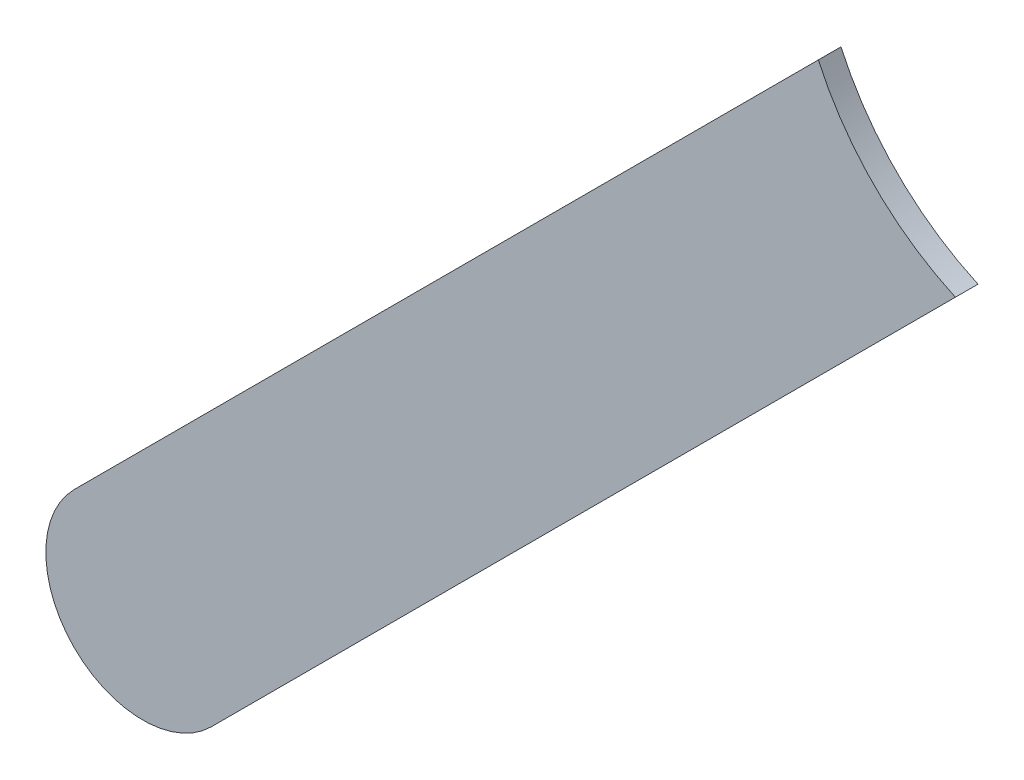
ISO-10303-21;
HEADER;
FILE_DESCRIPTION(('STEP AP214'),'2;1');
FILE_NAME('part.step','',(''),(''),'','','');
FILE_SCHEMA(('AUTOMOTIVE_DESIGN { 1 0 10303 214 1 1 1 1 }'));
ENDSEC;
DATA;
#1=APPLICATION_CONTEXT('core data for automotive mechanical design processes');
#2=APPLICATION_PROTOCOL_DEFINITION('international standard','automotive_design',2000,#1);
#3=PRODUCT_CONTEXT('',#1,'mechanical');
#4=PRODUCT('Part','Part','',(#3));
#5=PRODUCT_RELATED_PRODUCT_CATEGORY('part','',(#4));
#6=PRODUCT_DEFINITION_FORMATION('','',#4);
#7=PRODUCT_DEFINITION_CONTEXT('part definition',#1,'design');
#8=PRODUCT_DEFINITION('design','',#6,#7);
#9=PRODUCT_DEFINITION_SHAPE('','',#8);
#10=(LENGTH_UNIT() NAMED_UNIT(*) SI_UNIT(.MILLI.,.METRE.));
#11=(NAMED_UNIT(*) PLANE_ANGLE_UNIT() SI_UNIT($,.RADIAN.));
#12=(NAMED_UNIT(*) SI_UNIT($,.STERADIAN.) SOLID_ANGLE_UNIT());
#13=UNCERTAINTY_MEASURE_WITH_UNIT(LENGTH_MEASURE(1.E-05),#10,'distance_accuracy_value','');
#14=(GEOMETRIC_REPRESENTATION_CONTEXT(3) GLOBAL_UNCERTAINTY_ASSIGNED_CONTEXT((#13)) GLOBAL_UNIT_ASSIGNED_CONTEXT((#10,
#11,#12)) REPRESENTATION_CONTEXT('',''));
#15=CARTESIAN_POINT('',(0.,0.,0.));
#16=DIRECTION('',(0.,0.,1.));
#17=DIRECTION('',(1.,0.,0.));
#18=AXIS2_PLACEMENT_3D('',#15,#16,#17);
#19=CARTESIAN_POINT('',(170.251733,-71.104733,-0.035));
#20=DIRECTION('',(0.707106781186548,-0.707106781186548,0.));
#21=DIRECTION('',(0.,0.,-1.));
#22=AXIS2_PLACEMENT_3D('',#19,#20,#21);
#23=PLANE('',#22);
#24=DIRECTION('',(0.,0.,1.));
#25=VECTOR('',#24,1.);
#26=CARTESIAN_POINT('',(168.818533,-72.537933,-0.035));
#27=LINE('',#26,#25);
#28=CARTESIAN_POINT('',(168.818533,-72.537933,-0.035));
#29=VERTEX_POINT('',#28);
#30=CARTESIAN_POINT('',(168.818533,-72.537933,0.));
#31=VERTEX_POINT('',#30);
#32=EDGE_CURVE('E11',#29,#31,#27,.T.);
#33=ORIENTED_EDGE('',*,*,#32,.T.);
#34=DIRECTION('',(-0.707106781186548,-0.707106781186548,0.));
#35=VECTOR('',#34,1.);
#36=CARTESIAN_POINT('',(170.251733,-71.104733,0.));
#37=LINE('',#36,#35);
#38=CARTESIAN_POINT('',(169.97055282375,-71.38591317624,0.));
#39=VERTEX_POINT('',#38);
#40=EDGE_CURVE('E26',#39,#31,#37,.T.);
#41=ORIENTED_EDGE('',*,*,#40,.F.);
#42=DIRECTION('',(0.,0.,-1.));
#43=VECTOR('',#42,1.);
#44=CARTESIAN_POINT('',(169.97055282375,-71.38591317624,-0.045));
#45=LINE('',#44,#43);
#46=CARTESIAN_POINT('',(169.97055282375,-71.38591317624,-0.035));
#47=VERTEX_POINT('',#46);
#48=EDGE_CURVE('E73',#39,#47,#45,.T.);
#49=ORIENTED_EDGE('',*,*,#48,.T.);
#50=DIRECTION('',(-0.707106781186548,-0.707106781186548,0.));
#51=VECTOR('',#50,1.);
#52=CARTESIAN_POINT('',(170.251733,-71.104733,-0.035));
#53=LINE('',#52,#51);
#54=EDGE_CURVE('E104',#47,#29,#53,.T.);
#55=ORIENTED_EDGE('',*,*,#54,.T.);
#56=EDGE_LOOP('',(#33,#41,#49,#55));
#57=FACE_BOUND('',#56,.T.);
#58=ADVANCED_FACE('F17',(#57),#23,.F.);
#59=CARTESIAN_POINT('',(168.9245995,-72.6439995,-0.035));
#60=DIRECTION('',(0.,0.,-1.));
#61=DIRECTION('',(-0.707106781186548,0.707106781186548,0.));
#62=AXIS2_PLACEMENT_3D('',#59,#60,#61);
#63=CYLINDRICAL_SURFACE('',#62,0.150000682813);
#64=CARTESIAN_POINT('',(168.9245995,-72.6439995,-0.035));
#65=DIRECTION('',(0.,0.,1.));
#66=DIRECTION('',(-0.707106781186548,0.707106781186548,0.));
#67=AXIS2_PLACEMENT_3D('',#64,#65,#66);
#68=CIRCLE('',#67,0.150000682813);
#69=CARTESIAN_POINT('',(169.030666,-72.750066,-0.035));
#70=VERTEX_POINT('',#69);
#71=EDGE_CURVE('E76',#29,#70,#68,.T.);
#72=ORIENTED_EDGE('',*,*,#71,.T.);
#73=DIRECTION('',(0.,0.,1.));
#74=VECTOR('',#73,1.);
#75=CARTESIAN_POINT('',(169.030666,-72.750066,-0.035));
#76=LINE('',#75,#74);
#77=CARTESIAN_POINT('',(169.030666,-72.750066,0.));
#78=VERTEX_POINT('',#77);
#79=EDGE_CURVE('E87',#70,#78,#76,.T.);
#80=ORIENTED_EDGE('',*,*,#79,.T.);
#81=CARTESIAN_POINT('',(168.9245995,-72.6439995,0.));
#82=DIRECTION('',(0.,0.,1.));
#83=DIRECTION('',(-0.707106781186548,0.707106781186548,0.));
#84=AXIS2_PLACEMENT_3D('',#81,#82,#83);
#85=CIRCLE('',#84,0.150000682813);
#86=EDGE_CURVE('E82',#31,#78,#85,.T.);
#87=ORIENTED_EDGE('',*,*,#86,.F.);
#88=ORIENTED_EDGE('',*,*,#32,.F.);
#89=EDGE_LOOP('',(#72,#80,#87,#88));
#90=FACE_BOUND('',#89,.T.);
#91=ADVANCED_FACE('F19',(#90),#63,.T.);
#92=CARTESIAN_POINT('',(169.030666,-72.750066,0.));
#93=DIRECTION('',(0.,0.,1.));
#94=DIRECTION('',(1.,0.,0.));
#95=AXIS2_PLACEMENT_3D('',#92,#93,#94);
#96=PLANE('',#95);
#97=ORIENTED_EDGE('',*,*,#86,.T.);
#98=DIRECTION('',(0.707106781186548,0.707106781186548,0.));
#99=VECTOR('',#98,1.);
#100=CARTESIAN_POINT('',(169.030666,-72.750066,0.));
#101=LINE('',#100,#99);
#102=CARTESIAN_POINT('',(170.18268544653,-71.59804655346,0.));
#103=VERTEX_POINT('',#102);
#104=EDGE_CURVE('E79',#78,#103,#101,.T.);
#105=ORIENTED_EDGE('',*,*,#104,.T.);
#106=CARTESIAN_POINT('',(170.3578,-71.2108,0.));
#107=DIRECTION('',(0.,0.,-1.));
#108=DIRECTION('',(0.,-1.,0.));
#109=AXIS2_PLACEMENT_3D('',#106,#107,#108);
#110=CIRCLE('',#109,0.425);
#111=EDGE_CURVE('E67',#103,#39,#110,.T.);
#112=ORIENTED_EDGE('',*,*,#111,.T.);
#113=ORIENTED_EDGE('',*,*,#40,.T.);
#114=EDGE_LOOP('',(#97,#105,#112,#113));
#115=FACE_BOUND('',#114,.T.);
#116=ADVANCED_FACE('F80',(#115),#96,.T.);
#117=CARTESIAN_POINT('',(170.3578,-71.2108,-0.045));
#118=DIRECTION('',(0.,0.,-1.));
#119=DIRECTION('',(0.,-1.,0.));
#120=AXIS2_PLACEMENT_3D('',#117,#118,#119);
#121=CYLINDRICAL_SURFACE('',#120,0.425);
#122=ORIENTED_EDGE('',*,*,#111,.F.);
#123=DIRECTION('',(0.,0.,-1.));
#124=VECTOR('',#123,1.);
#125=CARTESIAN_POINT('',(170.18268544654,-71.59804655346,-0.045));
#126=LINE('',#125,#124);
#127=CARTESIAN_POINT('',(170.18268544653,-71.59804655346,-0.035));
#128=VERTEX_POINT('',#127);
#129=EDGE_CURVE('E72',#103,#128,#126,.T.);
#130=ORIENTED_EDGE('',*,*,#129,.T.);
#131=CARTESIAN_POINT('',(170.3578,-71.2108,-0.035));
#132=DIRECTION('',(0.,0.,-1.));
#133=DIRECTION('',(0.,-1.,0.));
#134=AXIS2_PLACEMENT_3D('',#131,#132,#133);
#135=CIRCLE('',#134,0.425);
#136=EDGE_CURVE('E107',#128,#47,#135,.T.);
#137=ORIENTED_EDGE('',*,*,#136,.T.);
#138=ORIENTED_EDGE('',*,*,#48,.F.);
#139=EDGE_LOOP('',(#122,#130,#137,#138));
#140=FACE_BOUND('',#139,.T.);
#141=ADVANCED_FACE('F69',(#140),#121,.F.);
#142=CARTESIAN_POINT('',(169.030666,-72.750066,-0.035));
#143=DIRECTION('',(0.,0.,1.));
#144=DIRECTION('',(1.,0.,0.));
#145=AXIS2_PLACEMENT_3D('',#142,#143,#144);
#146=PLANE('',#145);
#147=ORIENTED_EDGE('',*,*,#54,.F.);
#148=ORIENTED_EDGE('',*,*,#136,.F.);
#149=DIRECTION('',(0.707106781186548,0.707106781186548,0.));
#150=VECTOR('',#149,1.);
#151=CARTESIAN_POINT('',(169.030666,-72.750066,-0.035));
#152=LINE('',#151,#150);
#153=EDGE_CURVE('E92',#70,#128,#152,.T.);
#154=ORIENTED_EDGE('',*,*,#153,.F.);
#155=ORIENTED_EDGE('',*,*,#71,.F.);
#156=EDGE_LOOP('',(#147,#148,#154,#155));
#157=FACE_BOUND('',#156,.T.);
#158=ADVANCED_FACE('F120',(#157),#146,.F.);
#159=CARTESIAN_POINT('',(169.030666,-72.750066,-0.035));
#160=DIRECTION('',(-0.707106781186548,0.707106781186548,0.));
#161=DIRECTION('',(0.,0.,1.));
#162=AXIS2_PLACEMENT_3D('',#159,#160,#161);
#163=PLANE('',#162);
#164=ORIENTED_EDGE('',*,*,#129,.F.);
#165=ORIENTED_EDGE('',*,*,#104,.F.);
#166=ORIENTED_EDGE('',*,*,#79,.F.);
#167=ORIENTED_EDGE('',*,*,#153,.T.);
#168=EDGE_LOOP('',(#164,#165,#166,#167));
#169=FACE_BOUND('',#168,.T.);
#170=ADVANCED_FACE('F90',(#169),#163,.F.);
#171=CLOSED_SHELL('',(#58,#91,#116,#141,#158,#170));
#172=MANIFOLD_SOLID_BREP('B1',#171);
#173=ADVANCED_BREP_SHAPE_REPRESENTATION('',(#18,#172),#14);
#174=SHAPE_DEFINITION_REPRESENTATION(#9,#173);
ENDSEC;
END-ISO-10303-21;
